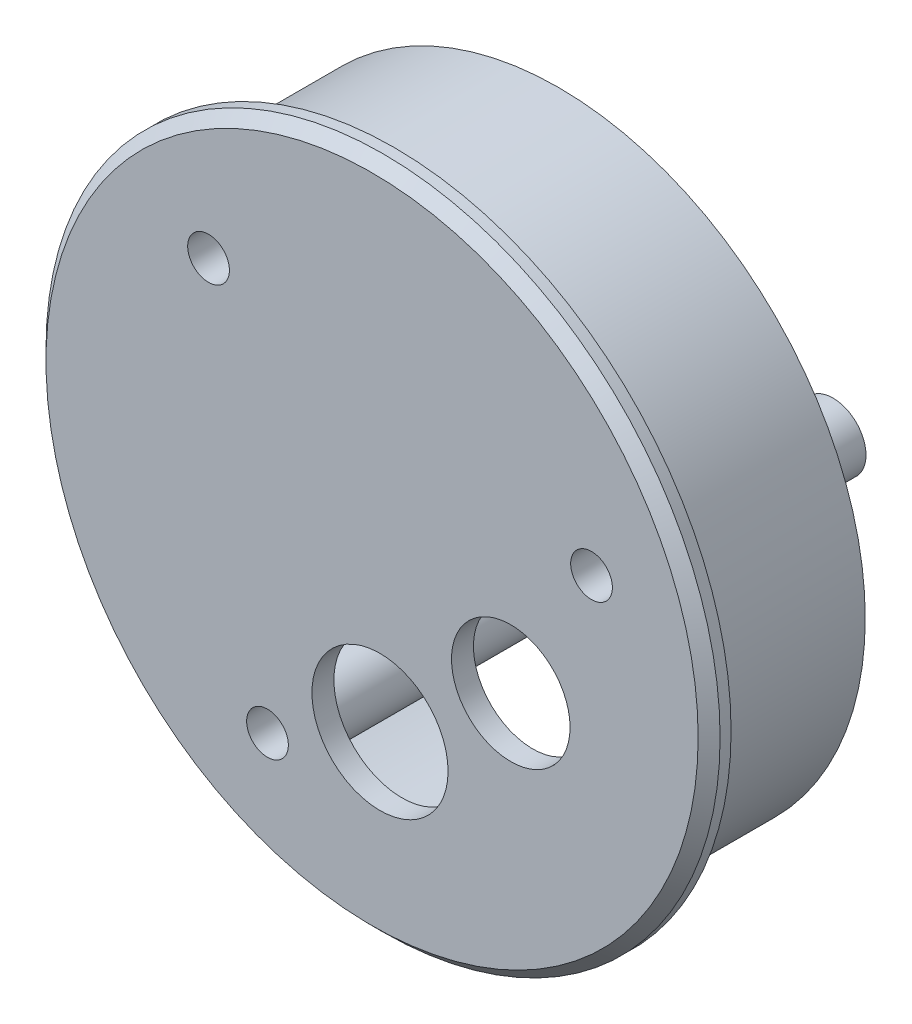
ISO-10303-21;
HEADER;
FILE_DESCRIPTION(('STEP AP214'),'2;1');
FILE_NAME('part.step','',(''),(''),'','','');
FILE_SCHEMA(('AUTOMOTIVE_DESIGN { 1 0 10303 214 1 1 1 1 }'));
ENDSEC;
DATA;
#1=APPLICATION_CONTEXT('core data for automotive mechanical design processes');
#2=APPLICATION_PROTOCOL_DEFINITION('international standard','automotive_design',2000,#1);
#3=PRODUCT_CONTEXT('',#1,'mechanical');
#4=PRODUCT('Part','Part','',(#3));
#5=PRODUCT_RELATED_PRODUCT_CATEGORY('part','',(#4));
#6=PRODUCT_DEFINITION_FORMATION('','',#4);
#7=PRODUCT_DEFINITION_CONTEXT('part definition',#1,'design');
#8=PRODUCT_DEFINITION('design','',#6,#7);
#9=PRODUCT_DEFINITION_SHAPE('','',#8);
#10=(LENGTH_UNIT() NAMED_UNIT(*) SI_UNIT(.MILLI.,.METRE.));
#11=(NAMED_UNIT(*) PLANE_ANGLE_UNIT() SI_UNIT($,.RADIAN.));
#12=(NAMED_UNIT(*) SI_UNIT($,.STERADIAN.) SOLID_ANGLE_UNIT());
#13=UNCERTAINTY_MEASURE_WITH_UNIT(LENGTH_MEASURE(1.E-05),#10,'distance_accuracy_value','');
#14=(GEOMETRIC_REPRESENTATION_CONTEXT(3) GLOBAL_UNCERTAINTY_ASSIGNED_CONTEXT((#13)) GLOBAL_UNIT_ASSIGNED_CONTEXT((#10,
#11,#12)) REPRESENTATION_CONTEXT('',''));
#15=CARTESIAN_POINT('',(0.,0.,0.));
#16=DIRECTION('',(0.,0.,1.));
#17=DIRECTION('',(1.,0.,0.));
#18=AXIS2_PLACEMENT_3D('',#15,#16,#17);
#19=CARTESIAN_POINT('',(0.,0.,85.));
#20=DIRECTION('',(0.,0.,1.));
#21=DIRECTION('',(1.,0.,0.));
#22=AXIS2_PLACEMENT_3D('',#19,#20,#21);
#23=CYLINDRICAL_SURFACE('',#22,27.92);
#24=CARTESIAN_POINT('',(0.,0.,85.));
#25=DIRECTION('',(0.,0.,1.));
#26=DIRECTION('',(1.,0.,0.));
#27=AXIS2_PLACEMENT_3D('',#24,#25,#26);
#28=CIRCLE('',#27,27.92);
#29=CARTESIAN_POINT('',(27.92,0.,85.));
#30=VERTEX_POINT('',#29);
#31=EDGE_CURVE('E93',#30,#30,#28,.F.);
#32=ORIENTED_EDGE('',*,*,#31,.F.);
#33=EDGE_LOOP('',(#32));
#34=FACE_BOUND('',#33,.T.);
#35=CARTESIAN_POINT('',(0.,0.,100.));
#36=DIRECTION('',(0.,0.,1.));
#37=DIRECTION('',(1.,0.,0.));
#38=AXIS2_PLACEMENT_3D('',#35,#36,#37);
#39=CIRCLE('',#38,27.92);
#40=CARTESIAN_POINT('',(27.92,0.,100.));
#41=VERTEX_POINT('',#40);
#42=EDGE_CURVE('E92',#41,#41,#39,.F.);
#43=ORIENTED_EDGE('',*,*,#42,.T.);
#44=EDGE_LOOP('',(#43));
#45=FACE_BOUND('',#44,.T.);
#46=ADVANCED_FACE('F34',(#34,#45),#23,.T.);
#47=CARTESIAN_POINT('',(0.,0.,85.));
#48=DIRECTION('',(0.,0.,1.));
#49=DIRECTION('',(1.,0.,0.));
#50=AXIS2_PLACEMENT_3D('',#47,#48,#49);
#51=CYLINDRICAL_SURFACE('',#50,26.12);
#52=CARTESIAN_POINT('',(0.,0.,85.));
#53=DIRECTION('',(0.,0.,1.));
#54=DIRECTION('',(1.,0.,0.));
#55=AXIS2_PLACEMENT_3D('',#52,#53,#54);
#56=CIRCLE('',#55,26.12);
#57=CARTESIAN_POINT('',(26.12,0.,85.));
#58=VERTEX_POINT('',#57);
#59=EDGE_CURVE('E96',#58,#58,#56,.F.);
#60=ORIENTED_EDGE('',*,*,#59,.T.);
#61=EDGE_LOOP('',(#60));
#62=FACE_BOUND('',#61,.T.);
#63=CARTESIAN_POINT('',(0.,0.,100.));
#64=DIRECTION('',(0.,0.,1.));
#65=DIRECTION('',(1.,0.,0.));
#66=AXIS2_PLACEMENT_3D('',#63,#64,#65);
#67=CIRCLE('',#66,26.12);
#68=CARTESIAN_POINT('',(26.12,0.,100.));
#69=VERTEX_POINT('',#68);
#70=EDGE_CURVE('E97',#69,#69,#67,.F.);
#71=ORIENTED_EDGE('',*,*,#70,.F.);
#72=EDGE_LOOP('',(#71));
#73=FACE_BOUND('',#72,.T.);
#74=ADVANCED_FACE('F128',(#62,#73),#51,.F.);
#75=CARTESIAN_POINT('',(0.,0.,85.));
#76=DIRECTION('',(0.,0.,1.));
#77=DIRECTION('',(1.,0.,0.));
#78=AXIS2_PLACEMENT_3D('',#75,#76,#77);
#79=PLANE('',#78);
#80=ORIENTED_EDGE('',*,*,#31,.T.);
#81=EDGE_LOOP('',(#80));
#82=FACE_BOUND('',#81,.T.);
#83=ORIENTED_EDGE('',*,*,#59,.F.);
#84=EDGE_LOOP('',(#83));
#85=FACE_BOUND('',#84,.T.);
#86=ADVANCED_FACE('F118',(#82,#85),#79,.F.);
#87=CARTESIAN_POINT('',(0.,0.,100.));
#88=DIRECTION('',(0.,0.,1.));
#89=DIRECTION('',(1.,0.,0.));
#90=AXIS2_PLACEMENT_3D('',#87,#88,#89);
#91=PLANE('',#90);
#92=CARTESIAN_POINT('',(-9.52568532359752,-19.2746288969671,100.));
#93=DIRECTION('',(0.,0.,1.));
#94=DIRECTION('',(1.,0.,0.));
#95=AXIS2_PLACEMENT_3D('',#92,#93,#94);
#96=CIRCLE('',#95,3.);
#97=CARTESIAN_POINT('',(-6.52568532359752,-19.2746288969671,100.));
#98=VERTEX_POINT('',#97);
#99=EDGE_CURVE('E10',#98,#98,#96,.F.);
#100=ORIENTED_EDGE('',*,*,#99,.F.);
#101=EDGE_LOOP('',(#100));
#102=FACE_BOUND('',#101,.T.);
#103=CARTESIAN_POINT('',(-14.8962577488949,15.5032740115915,100.));
#104=DIRECTION('',(0.,0.,1.));
#105=DIRECTION('',(1.,0.,0.));
#106=AXIS2_PLACEMENT_3D('',#103,#104,#105);
#107=CIRCLE('',#106,3.);
#108=CARTESIAN_POINT('',(-11.8962577488949,15.5032740115915,100.));
#109=VERTEX_POINT('',#108);
#110=EDGE_CURVE('E43',#109,#109,#107,.F.);
#111=ORIENTED_EDGE('',*,*,#110,.F.);
#112=EDGE_LOOP('',(#111));
#113=FACE_BOUND('',#112,.T.);
#114=CARTESIAN_POINT('',(19.9875677342176,7.92130898716008,100.));
#115=DIRECTION('',(0.,0.,1.));
#116=DIRECTION('',(1.,0.,0.));
#117=AXIS2_PLACEMENT_3D('',#114,#115,#116);
#118=CIRCLE('',#117,3.);
#119=CARTESIAN_POINT('',(22.9875677342176,7.92130898716008,100.));
#120=VERTEX_POINT('',#119);
#121=EDGE_CURVE('E48',#120,#120,#118,.F.);
#122=ORIENTED_EDGE('',*,*,#121,.F.);
#123=EDGE_LOOP('',(#122));
#124=FACE_BOUND('',#123,.T.);
#125=CARTESIAN_POINT('',(12.6339957316625,-5.03638072314056,100.));
#126=DIRECTION('',(0.,0.,1.));
#127=DIRECTION('',(1.,0.,0.));
#128=AXIS2_PLACEMENT_3D('',#125,#126,#127);
#129=CIRCLE('',#128,5.4);
#130=CARTESIAN_POINT('',(18.0339957316625,-5.03638072314056,100.));
#131=VERTEX_POINT('',#130);
#132=EDGE_CURVE('E86',#131,#131,#129,.T.);
#133=ORIENTED_EDGE('',*,*,#132,.T.);
#134=EDGE_LOOP('',(#133));
#135=FACE_BOUND('',#134,.T.);
#136=CARTESIAN_POINT('',(0.721507926307138,-14.0520151331789,100.));
#137=DIRECTION('',(0.,0.,1.));
#138=DIRECTION('',(1.,0.,0.));
#139=AXIS2_PLACEMENT_3D('',#136,#137,#138);
#140=CIRCLE('',#139,6.2);
#141=CARTESIAN_POINT('',(6.92150792630714,-14.0520151331789,100.));
#142=VERTEX_POINT('',#141);
#143=EDGE_CURVE('E81',#142,#142,#140,.T.);
#144=ORIENTED_EDGE('',*,*,#143,.T.);
#145=EDGE_LOOP('',(#144));
#146=FACE_BOUND('',#145,.T.);
#147=ORIENTED_EDGE('',*,*,#70,.T.);
#148=EDGE_LOOP('',(#147));
#149=FACE_BOUND('',#148,.T.);
#150=ADVANCED_FACE('F114',(#102,#113,#124,#135,#146,#149),#91,.F.);
#151=CARTESIAN_POINT('',(0.,0.,102.));
#152=DIRECTION('',(0.,0.,-1.));
#153=DIRECTION('',(-1.,0.,0.));
#154=AXIS2_PLACEMENT_3D('',#151,#152,#153);
#155=CYLINDRICAL_SURFACE('',#154,30.7);
#156=CARTESIAN_POINT('',(0.,0.,101.));
#157=DIRECTION('',(0.,0.,1.));
#158=DIRECTION('',(1.,0.,0.));
#159=AXIS2_PLACEMENT_3D('',#156,#157,#158);
#160=CIRCLE('',#159,30.7);
#161=CARTESIAN_POINT('',(30.7,0.,101.));
#162=VERTEX_POINT('',#161);
#163=EDGE_CURVE('E100',#162,#162,#160,.F.);
#164=ORIENTED_EDGE('',*,*,#163,.T.);
#165=EDGE_LOOP('',(#164));
#166=FACE_BOUND('',#165,.T.);
#167=CARTESIAN_POINT('',(0.,0.,100.));
#168=DIRECTION('',(0.,0.,1.));
#169=DIRECTION('',(1.,0.,0.));
#170=AXIS2_PLACEMENT_3D('',#167,#168,#169);
#171=CIRCLE('',#170,30.7);
#172=CARTESIAN_POINT('',(30.7,0.,100.));
#173=VERTEX_POINT('',#172);
#174=EDGE_CURVE('E89',#173,#173,#171,.F.);
#175=ORIENTED_EDGE('',*,*,#174,.F.);
#176=EDGE_LOOP('',(#175));
#177=FACE_BOUND('',#176,.T.);
#178=ADVANCED_FACE('F117',(#166,#177),#155,.T.);
#179=CARTESIAN_POINT('',(0.,0.,102.));
#180=DIRECTION('',(0.,0.,1.));
#181=DIRECTION('',(1.,0.,0.));
#182=AXIS2_PLACEMENT_3D('',#179,#180,#181);
#183=PLANE('',#182);
#184=CARTESIAN_POINT('',(19.9875677342176,7.92130898716008,102.));
#185=DIRECTION('',(0.,0.,1.));
#186=DIRECTION('',(1.,0.,0.));
#187=AXIS2_PLACEMENT_3D('',#184,#185,#186);
#188=CIRCLE('',#187,1.9);
#189=CARTESIAN_POINT('',(21.8875677342176,7.92130898716008,102.));
#190=VERTEX_POINT('',#189);
#191=EDGE_CURVE('E55',#190,#190,#188,.T.);
#192=ORIENTED_EDGE('',*,*,#191,.F.);
#193=EDGE_LOOP('',(#192));
#194=FACE_BOUND('',#193,.T.);
#195=CARTESIAN_POINT('',(-9.52568532359752,-19.2746288969671,102.));
#196=DIRECTION('',(0.,0.,1.));
#197=DIRECTION('',(1.,0.,0.));
#198=AXIS2_PLACEMENT_3D('',#195,#196,#197);
#199=CIRCLE('',#198,1.89999999999934);
#200=CARTESIAN_POINT('',(-7.62568532359818,-19.2746288969671,102.));
#201=VERTEX_POINT('',#200);
#202=EDGE_CURVE('E196',#201,#201,#199,.T.);
#203=ORIENTED_EDGE('',*,*,#202,.F.);
#204=EDGE_LOOP('',(#203));
#205=FACE_BOUND('',#204,.T.);
#206=CARTESIAN_POINT('',(-14.8962577488949,15.5032740115915,102.));
#207=DIRECTION('',(0.,0.,1.));
#208=DIRECTION('',(1.,0.,0.));
#209=AXIS2_PLACEMENT_3D('',#206,#207,#208);
#210=CIRCLE('',#209,1.9);
#211=CARTESIAN_POINT('',(-12.9962577488949,15.5032740115915,102.));
#212=VERTEX_POINT('',#211);
#213=EDGE_CURVE('E72',#212,#212,#210,.T.);
#214=ORIENTED_EDGE('',*,*,#213,.F.);
#215=EDGE_LOOP('',(#214));
#216=FACE_BOUND('',#215,.T.);
#217=CARTESIAN_POINT('',(12.6339957316625,-5.03638072314056,102.));
#218=DIRECTION('',(0.,0.,1.));
#219=DIRECTION('',(1.,0.,0.));
#220=AXIS2_PLACEMENT_3D('',#217,#218,#219);
#221=CIRCLE('',#220,5.4);
#222=CARTESIAN_POINT('',(18.0339957316625,-5.03638072314056,102.));
#223=VERTEX_POINT('',#222);
#224=EDGE_CURVE('E78',#223,#223,#221,.T.);
#225=ORIENTED_EDGE('',*,*,#224,.F.);
#226=EDGE_LOOP('',(#225));
#227=FACE_BOUND('',#226,.T.);
#228=CARTESIAN_POINT('',(0.721507926307138,-14.0520151331789,102.));
#229=DIRECTION('',(0.,0.,1.));
#230=DIRECTION('',(1.,0.,0.));
#231=AXIS2_PLACEMENT_3D('',#228,#229,#230);
#232=CIRCLE('',#231,6.2);
#233=CARTESIAN_POINT('',(6.92150792630714,-14.0520151331789,102.));
#234=VERTEX_POINT('',#233);
#235=EDGE_CURVE('E77',#234,#234,#232,.T.);
#236=ORIENTED_EDGE('',*,*,#235,.F.);
#237=EDGE_LOOP('',(#236));
#238=FACE_BOUND('',#237,.T.);
#239=CARTESIAN_POINT('',(0.,0.,102.));
#240=DIRECTION('',(0.,0.,1.));
#241=DIRECTION('',(1.,0.,0.));
#242=AXIS2_PLACEMENT_3D('',#239,#240,#241);
#243=CIRCLE('',#242,29.7);
#244=CARTESIAN_POINT('',(29.7,0.,102.));
#245=VERTEX_POINT('',#244);
#246=EDGE_CURVE('E107',#245,#245,#243,.T.);
#247=ORIENTED_EDGE('',*,*,#246,.T.);
#248=EDGE_LOOP('',(#247));
#249=FACE_BOUND('',#248,.T.);
#250=ADVANCED_FACE('F142',(#194,#205,#216,#227,#238,#249),#183,.T.);
#251=ORIENTED_EDGE('',*,*,#42,.F.);
#252=EDGE_LOOP('',(#251));
#253=FACE_BOUND('',#252,.T.);
#254=ORIENTED_EDGE('',*,*,#174,.T.);
#255=EDGE_LOOP('',(#254));
#256=FACE_BOUND('',#255,.T.);
#257=ADVANCED_FACE('F121',(#253,#256),#91,.F.);
#258=CARTESIAN_POINT('',(0.,0.,101.));
#259=DIRECTION('',(0.,0.,-1.));
#260=DIRECTION('',(-1.,0.,0.));
#261=AXIS2_PLACEMENT_3D('',#258,#259,#260);
#262=CONICAL_SURFACE('',#261,30.7,0.785398163397452);
#263=ORIENTED_EDGE('',*,*,#246,.F.);
#264=EDGE_LOOP('',(#263));
#265=FACE_BOUND('',#264,.T.);
#266=ORIENTED_EDGE('',*,*,#163,.F.);
#267=EDGE_LOOP('',(#266));
#268=FACE_BOUND('',#267,.T.);
#269=ADVANCED_FACE('F37',(#265,#268),#262,.T.);
#270=CARTESIAN_POINT('',(0.721507926307138,-14.0520151331789,93.));
#271=DIRECTION('',(0.,0.,1.));
#272=DIRECTION('',(1.,0.,0.));
#273=AXIS2_PLACEMENT_3D('',#270,#271,#272);
#274=CYLINDRICAL_SURFACE('',#273,6.2);
#275=ORIENTED_EDGE('',*,*,#235,.T.);
#276=EDGE_LOOP('',(#275));
#277=FACE_BOUND('',#276,.T.);
#278=ORIENTED_EDGE('',*,*,#143,.F.);
#279=EDGE_LOOP('',(#278));
#280=FACE_BOUND('',#279,.T.);
#281=ADVANCED_FACE('F150',(#277,#280),#274,.F.);
#282=CARTESIAN_POINT('',(12.6339957316625,-5.03638072314056,93.));
#283=DIRECTION('',(0.,0.,1.));
#284=DIRECTION('',(1.,0.,0.));
#285=AXIS2_PLACEMENT_3D('',#282,#283,#284);
#286=CYLINDRICAL_SURFACE('',#285,5.4);
#287=ORIENTED_EDGE('',*,*,#224,.T.);
#288=EDGE_LOOP('',(#287));
#289=FACE_BOUND('',#288,.T.);
#290=ORIENTED_EDGE('',*,*,#132,.F.);
#291=EDGE_LOOP('',(#290));
#292=FACE_BOUND('',#291,.T.);
#293=ADVANCED_FACE('F153',(#289,#292),#286,.F.);
#294=CARTESIAN_POINT('',(19.9875677342176,7.92130898716008,80.));
#295=DIRECTION('',(0.,0.,1.));
#296=DIRECTION('',(1.,0.,0.));
#297=AXIS2_PLACEMENT_3D('',#294,#295,#296);
#298=CYLINDRICAL_SURFACE('',#297,3.);
#299=CARTESIAN_POINT('',(19.9875677342176,7.92130898716008,80.));
#300=DIRECTION('',(0.,0.,-1.));
#301=DIRECTION('',(-1.,0.,0.));
#302=AXIS2_PLACEMENT_3D('',#299,#300,#301);
#303=CIRCLE('',#302,3.);
#304=CARTESIAN_POINT('',(16.9875677342176,7.92130898716008,80.));
#305=VERTEX_POINT('',#304);
#306=EDGE_CURVE('E69',#305,#305,#303,.T.);
#307=ORIENTED_EDGE('',*,*,#306,.F.);
#308=EDGE_LOOP('',(#307));
#309=FACE_BOUND('',#308,.T.);
#310=ORIENTED_EDGE('',*,*,#121,.T.);
#311=EDGE_LOOP('',(#310));
#312=FACE_BOUND('',#311,.T.);
#313=ADVANCED_FACE('F112',(#309,#312),#298,.T.);
#314=CARTESIAN_POINT('',(19.9875677342176,7.92130898716008,80.));
#315=DIRECTION('',(0.,0.,-1.));
#316=DIRECTION('',(-1.,0.,0.));
#317=AXIS2_PLACEMENT_3D('',#314,#315,#316);
#318=PLANE('',#317);
#319=CARTESIAN_POINT('',(19.9875677342176,7.92130898716008,80.));
#320=DIRECTION('',(0.,0.,-1.));
#321=DIRECTION('',(-1.,0.,0.));
#322=AXIS2_PLACEMENT_3D('',#319,#320,#321);
#323=CIRCLE('',#322,1.9);
#324=CARTESIAN_POINT('',(18.0875677342176,7.92130898716008,80.));
#325=VERTEX_POINT('',#324);
#326=EDGE_CURVE('E39',#325,#325,#323,.T.);
#327=ORIENTED_EDGE('',*,*,#326,.F.);
#328=EDGE_LOOP('',(#327));
#329=FACE_BOUND('',#328,.T.);
#330=ORIENTED_EDGE('',*,*,#306,.T.);
#331=EDGE_LOOP('',(#330));
#332=FACE_BOUND('',#331,.T.);
#333=ADVANCED_FACE('F160',(#329,#332),#318,.T.);
#334=CARTESIAN_POINT('',(-14.8962577488949,15.5032740115915,80.));
#335=DIRECTION('',(0.,0.,1.));
#336=DIRECTION('',(1.,0.,0.));
#337=AXIS2_PLACEMENT_3D('',#334,#335,#336);
#338=CYLINDRICAL_SURFACE('',#337,3.);
#339=CARTESIAN_POINT('',(-14.8962577488949,15.5032740115915,80.));
#340=DIRECTION('',(0.,0.,-1.));
#341=DIRECTION('',(-1.,0.,0.));
#342=AXIS2_PLACEMENT_3D('',#339,#340,#341);
#343=CIRCLE('',#342,3.);
#344=CARTESIAN_POINT('',(-17.8962577488949,15.5032740115915,80.));
#345=VERTEX_POINT('',#344);
#346=EDGE_CURVE('E64',#345,#345,#343,.T.);
#347=ORIENTED_EDGE('',*,*,#346,.F.);
#348=EDGE_LOOP('',(#347));
#349=FACE_BOUND('',#348,.T.);
#350=ORIENTED_EDGE('',*,*,#110,.T.);
#351=EDGE_LOOP('',(#350));
#352=FACE_BOUND('',#351,.T.);
#353=ADVANCED_FACE('F164',(#349,#352),#338,.T.);
#354=CARTESIAN_POINT('',(-14.8962577488949,15.5032740115915,80.));
#355=DIRECTION('',(0.,0.,-1.));
#356=DIRECTION('',(-1.,0.,0.));
#357=AXIS2_PLACEMENT_3D('',#354,#355,#356);
#358=PLANE('',#357);
#359=CARTESIAN_POINT('',(-14.8962577488949,15.5032740115915,80.));
#360=DIRECTION('',(0.,0.,-1.));
#361=DIRECTION('',(-1.,0.,0.));
#362=AXIS2_PLACEMENT_3D('',#359,#360,#361);
#363=CIRCLE('',#362,1.9);
#364=CARTESIAN_POINT('',(-16.7962577488949,15.5032740115915,80.));
#365=VERTEX_POINT('',#364);
#366=EDGE_CURVE('E54',#365,#365,#363,.T.);
#367=ORIENTED_EDGE('',*,*,#366,.F.);
#368=EDGE_LOOP('',(#367));
#369=FACE_BOUND('',#368,.T.);
#370=ORIENTED_EDGE('',*,*,#346,.T.);
#371=EDGE_LOOP('',(#370));
#372=FACE_BOUND('',#371,.T.);
#373=ADVANCED_FACE('F168',(#369,#372),#358,.T.);
#374=CARTESIAN_POINT('',(-9.52568532359752,-19.2746288969671,80.));
#375=DIRECTION('',(0.,0.,1.));
#376=DIRECTION('',(1.,0.,0.));
#377=AXIS2_PLACEMENT_3D('',#374,#375,#376);
#378=CYLINDRICAL_SURFACE('',#377,3.);
#379=CARTESIAN_POINT('',(-9.52568532359752,-19.2746288969671,80.));
#380=DIRECTION('',(0.,0.,-1.));
#381=DIRECTION('',(-1.,0.,0.));
#382=AXIS2_PLACEMENT_3D('',#379,#380,#381);
#383=CIRCLE('',#382,3.);
#384=CARTESIAN_POINT('',(-12.5256853235975,-19.2746288969671,80.));
#385=VERTEX_POINT('',#384);
#386=EDGE_CURVE('E60',#385,#385,#383,.T.);
#387=ORIENTED_EDGE('',*,*,#386,.F.);
#388=EDGE_LOOP('',(#387));
#389=FACE_BOUND('',#388,.T.);
#390=ORIENTED_EDGE('',*,*,#99,.T.);
#391=EDGE_LOOP('',(#390));
#392=FACE_BOUND('',#391,.T.);
#393=ADVANCED_FACE('F172',(#389,#392),#378,.T.);
#394=CARTESIAN_POINT('',(-9.52568532359752,-19.2746288969671,80.));
#395=DIRECTION('',(0.,0.,-1.));
#396=DIRECTION('',(-1.,0.,0.));
#397=AXIS2_PLACEMENT_3D('',#394,#395,#396);
#398=PLANE('',#397);
#399=CARTESIAN_POINT('',(-9.52568532359752,-19.2746288969671,80.));
#400=DIRECTION('',(0.,0.,-1.));
#401=DIRECTION('',(-1.,0.,0.));
#402=AXIS2_PLACEMENT_3D('',#399,#400,#401);
#403=CIRCLE('',#402,1.89999999999934);
#404=CARTESIAN_POINT('',(-11.4256853235969,-19.2746288969671,80.));
#405=VERTEX_POINT('',#404);
#406=EDGE_CURVE('E52',#405,#405,#403,.T.);
#407=ORIENTED_EDGE('',*,*,#406,.F.);
#408=EDGE_LOOP('',(#407));
#409=FACE_BOUND('',#408,.T.);
#410=ORIENTED_EDGE('',*,*,#386,.T.);
#411=EDGE_LOOP('',(#410));
#412=FACE_BOUND('',#411,.T.);
#413=ADVANCED_FACE('F176',(#409,#412),#398,.T.);
#414=CARTESIAN_POINT('',(-9.52568532359752,-19.2746288969671,73.));
#415=DIRECTION('',(0.,0.,1.));
#416=DIRECTION('',(1.,0.,0.));
#417=AXIS2_PLACEMENT_3D('',#414,#415,#416);
#418=CYLINDRICAL_SURFACE('',#417,1.89999999999934);
#419=ORIENTED_EDGE('',*,*,#406,.T.);
#420=EDGE_LOOP('',(#419));
#421=FACE_BOUND('',#420,.T.);
#422=ORIENTED_EDGE('',*,*,#202,.T.);
#423=EDGE_LOOP('',(#422));
#424=FACE_BOUND('',#423,.T.);
#425=ADVANCED_FACE('F180',(#421,#424),#418,.F.);
#426=CARTESIAN_POINT('',(-14.8962577488949,15.5032740115915,73.));
#427=DIRECTION('',(0.,0.,1.));
#428=DIRECTION('',(1.,0.,0.));
#429=AXIS2_PLACEMENT_3D('',#426,#427,#428);
#430=CYLINDRICAL_SURFACE('',#429,1.9);
#431=ORIENTED_EDGE('',*,*,#366,.T.);
#432=EDGE_LOOP('',(#431));
#433=FACE_BOUND('',#432,.T.);
#434=ORIENTED_EDGE('',*,*,#213,.T.);
#435=EDGE_LOOP('',(#434));
#436=FACE_BOUND('',#435,.T.);
#437=ADVANCED_FACE('F182',(#433,#436),#430,.F.);
#438=CARTESIAN_POINT('',(19.9875677342176,7.92130898716008,73.));
#439=DIRECTION('',(0.,0.,1.));
#440=DIRECTION('',(1.,0.,0.));
#441=AXIS2_PLACEMENT_3D('',#438,#439,#440);
#442=CYLINDRICAL_SURFACE('',#441,1.9);
#443=ORIENTED_EDGE('',*,*,#326,.T.);
#444=EDGE_LOOP('',(#443));
#445=FACE_BOUND('',#444,.T.);
#446=ORIENTED_EDGE('',*,*,#191,.T.);
#447=EDGE_LOOP('',(#446));
#448=FACE_BOUND('',#447,.T.);
#449=ADVANCED_FACE('F185',(#445,#448),#442,.F.);
#450=CLOSED_SHELL('',(#46,#74,#86,#150,#178,#250,#257,#269,#281,#293,#313,#333,#353,#373,#393,
#413,#425,#437,#449));
#451=MANIFOLD_SOLID_BREP('B2',#450);
#452=ADVANCED_BREP_SHAPE_REPRESENTATION('',(#18,#451),#14);
#453=SHAPE_DEFINITION_REPRESENTATION(#9,#452);
ENDSEC;
END-ISO-10303-21;
